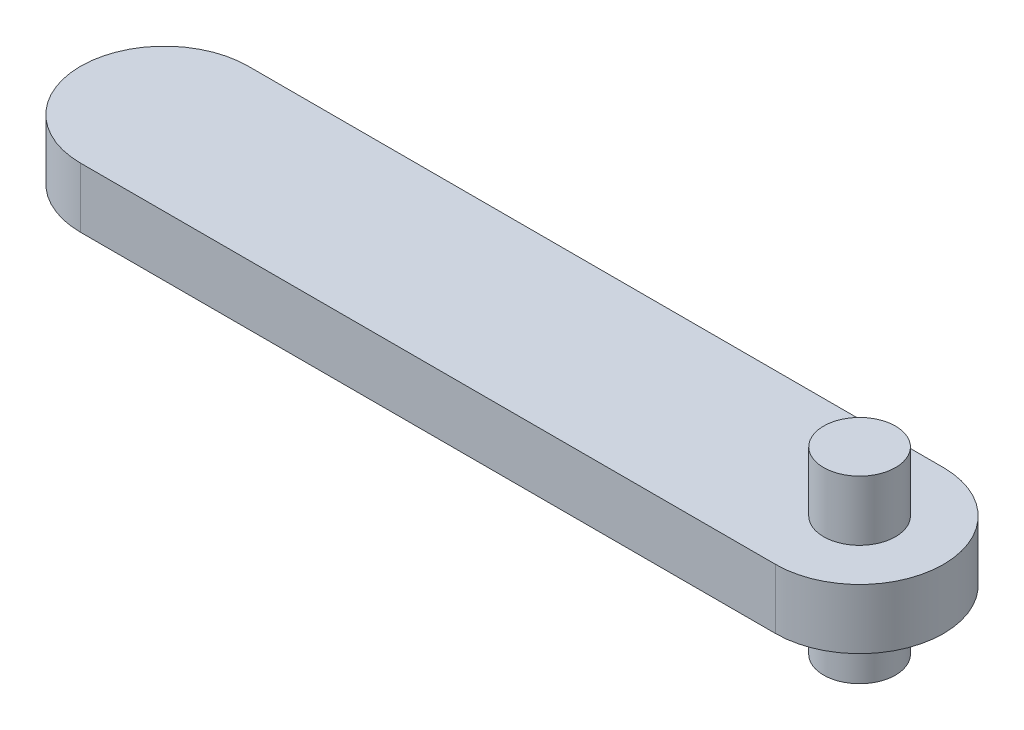
ISO-10303-21;
HEADER;
FILE_DESCRIPTION(('STEP AP214'),'2;1');
FILE_NAME('part.step','',(''),(''),'','','');
FILE_SCHEMA(('AUTOMOTIVE_DESIGN { 1 0 10303 214 1 1 1 1 }'));
ENDSEC;
DATA;
#1=APPLICATION_CONTEXT('core data for automotive mechanical design processes');
#2=APPLICATION_PROTOCOL_DEFINITION('international standard','automotive_design',2000,#1);
#3=PRODUCT_CONTEXT('',#1,'mechanical');
#4=PRODUCT('Part','Part','',(#3));
#5=PRODUCT_RELATED_PRODUCT_CATEGORY('part','',(#4));
#6=PRODUCT_DEFINITION_FORMATION('','',#4);
#7=PRODUCT_DEFINITION_CONTEXT('part definition',#1,'design');
#8=PRODUCT_DEFINITION('design','',#6,#7);
#9=PRODUCT_DEFINITION_SHAPE('','',#8);
#10=(LENGTH_UNIT() NAMED_UNIT(*) SI_UNIT(.MILLI.,.METRE.));
#11=(NAMED_UNIT(*) PLANE_ANGLE_UNIT() SI_UNIT($,.RADIAN.));
#12=(NAMED_UNIT(*) SI_UNIT($,.STERADIAN.) SOLID_ANGLE_UNIT());
#13=UNCERTAINTY_MEASURE_WITH_UNIT(LENGTH_MEASURE(1.E-05),#10,'distance_accuracy_value','');
#14=(GEOMETRIC_REPRESENTATION_CONTEXT(3) GLOBAL_UNCERTAINTY_ASSIGNED_CONTEXT((#13)) GLOBAL_UNIT_ASSIGNED_CONTEXT((#10,
#11,#12)) REPRESENTATION_CONTEXT('',''));
#15=CARTESIAN_POINT('',(0.,0.,0.));
#16=DIRECTION('',(0.,0.,1.));
#17=DIRECTION('',(1.,0.,0.));
#18=AXIS2_PLACEMENT_3D('',#15,#16,#17);
#19=CARTESIAN_POINT('',(-489.944100226293,150.,107.40077744332));
#20=DIRECTION('',(0.,-1.,0.));
#21=DIRECTION('',(0.,0.,-1.));
#22=AXIS2_PLACEMENT_3D('',#19,#20,#21);
#23=PLANE('',#22);
#24=CARTESIAN_POINT('',(-429.944100226293,150.,107.40077744332));
#25=DIRECTION('',(0.,1.,0.));
#26=DIRECTION('',(1.,0.,0.));
#27=AXIS2_PLACEMENT_3D('',#24,#25,#26);
#28=CIRCLE('',#27,15.);
#29=CARTESIAN_POINT('',(-414.944100226293,150.,107.40077744332));
#30=VERTEX_POINT('',#29);
#31=EDGE_CURVE('E100',#30,#30,#28,.T.);
#32=ORIENTED_EDGE('',*,*,#31,.F.);
#33=EDGE_LOOP('',(#32));
#34=FACE_BOUND('',#33,.T.);
#35=DIRECTION('',(1.,0.,0.));
#36=VECTOR('',#35,1.);
#37=CARTESIAN_POINT('',(-519.944100226293,150.,72.4007774433196));
#38=LINE('',#37,#36);
#39=CARTESIAN_POINT('',(-719.944100226293,150.,72.4007774433196));
#40=VERTEX_POINT('',#39);
#41=CARTESIAN_POINT('',(-429.944100226293,150.,72.4007774433196));
#42=VERTEX_POINT('',#41);
#43=EDGE_CURVE('E82',#40,#42,#38,.T.);
#44=ORIENTED_EDGE('',*,*,#43,.F.);
#45=CARTESIAN_POINT('',(-719.944100226293,150.,107.40077744332));
#46=DIRECTION('',(0.,-1.,0.));
#47=DIRECTION('',(0.,0.,1.));
#48=AXIS2_PLACEMENT_3D('',#45,#46,#47);
#49=CIRCLE('',#48,35.);
#50=CARTESIAN_POINT('',(-719.944100226293,150.,142.40077744332));
#51=VERTEX_POINT('',#50);
#52=EDGE_CURVE('E107',#51,#40,#49,.T.);
#53=ORIENTED_EDGE('',*,*,#52,.F.);
#54=DIRECTION('',(-1.,0.,0.));
#55=VECTOR('',#54,1.);
#56=CARTESIAN_POINT('',(-459.944100226293,150.,142.40077744332));
#57=LINE('',#56,#55);
#58=CARTESIAN_POINT('',(-429.944100226293,150.,142.40077744332));
#59=VERTEX_POINT('',#58);
#60=EDGE_CURVE('E104',#59,#51,#57,.T.);
#61=ORIENTED_EDGE('',*,*,#60,.F.);
#62=CARTESIAN_POINT('',(-429.944100226293,150.,107.40077744332));
#63=DIRECTION('',(0.,-1.,0.));
#64=DIRECTION('',(0.,0.,-1.));
#65=AXIS2_PLACEMENT_3D('',#62,#63,#64);
#66=CIRCLE('',#65,35.);
#67=EDGE_CURVE('E68',#42,#59,#66,.T.);
#68=ORIENTED_EDGE('',*,*,#67,.F.);
#69=EDGE_LOOP('',(#44,#53,#61,#68));
#70=FACE_BOUND('',#69,.T.);
#71=ADVANCED_FACE('F43',(#34,#70),#23,.F.);
#72=CARTESIAN_POINT('',(-429.944100226293,175.,107.40077744332));
#73=DIRECTION('',(0.,-1.,0.));
#74=DIRECTION('',(0.,0.,-1.));
#75=AXIS2_PLACEMENT_3D('',#72,#73,#74);
#76=PLANE('',#75);
#77=CARTESIAN_POINT('',(-429.944100226293,175.,107.40077744332));
#78=DIRECTION('',(0.,1.,0.));
#79=DIRECTION('',(1.,0.,0.));
#80=AXIS2_PLACEMENT_3D('',#77,#78,#79);
#81=CIRCLE('',#80,15.);
#82=CARTESIAN_POINT('',(-414.944100226293,175.,107.40077744332));
#83=VERTEX_POINT('',#82);
#84=EDGE_CURVE('E118',#83,#83,#81,.T.);
#85=ORIENTED_EDGE('',*,*,#84,.T.);
#86=EDGE_LOOP('',(#85));
#87=FACE_BOUND('',#86,.T.);
#88=ADVANCED_FACE('F139',(#87),#76,.F.);
#89=CARTESIAN_POINT('',(-429.944100226293,100.,107.40077744332));
#90=DIRECTION('',(0.,-1.,0.));
#91=DIRECTION('',(1.,0.,0.));
#92=AXIS2_PLACEMENT_3D('',#89,#90,#91);
#93=CYLINDRICAL_SURFACE('',#92,15.);
#94=ORIENTED_EDGE('',*,*,#31,.T.);
#95=EDGE_LOOP('',(#94));
#96=FACE_BOUND('',#95,.T.);
#97=ORIENTED_EDGE('',*,*,#84,.F.);
#98=EDGE_LOOP('',(#97));
#99=FACE_BOUND('',#98,.T.);
#100=ADVANCED_FACE('F144',(#96,#99),#93,.T.);
#101=CARTESIAN_POINT('',(-429.944100226293,125.,107.40077744332));
#102=DIRECTION('',(0.,-1.,0.));
#103=DIRECTION('',(0.,0.,-1.));
#104=AXIS2_PLACEMENT_3D('',#101,#102,#103);
#105=CYLINDRICAL_SURFACE('',#104,35.);
#106=CARTESIAN_POINT('',(-429.944100226293,125.,107.40077744332));
#107=DIRECTION('',(0.,1.,0.));
#108=DIRECTION('',(0.,0.,-1.));
#109=AXIS2_PLACEMENT_3D('',#106,#107,#108);
#110=CIRCLE('',#109,35.);
#111=CARTESIAN_POINT('',(-429.944100226293,125.,142.40077744332));
#112=VERTEX_POINT('',#111);
#113=CARTESIAN_POINT('',(-429.944100226293,125.,72.4007774433196));
#114=VERTEX_POINT('',#113);
#115=EDGE_CURVE('E99',#112,#114,#110,.T.);
#116=ORIENTED_EDGE('',*,*,#115,.T.);
#117=DIRECTION('',(0.,1.,0.));
#118=VECTOR('',#117,1.);
#119=CARTESIAN_POINT('',(-429.944100226293,125.,72.4007774433196));
#120=LINE('',#119,#118);
#121=EDGE_CURVE('E116',#114,#42,#120,.T.);
#122=ORIENTED_EDGE('',*,*,#121,.T.);
#123=ORIENTED_EDGE('',*,*,#67,.T.);
#124=DIRECTION('',(0.,1.,0.));
#125=VECTOR('',#124,1.);
#126=CARTESIAN_POINT('',(-429.944100226293,125.,142.40077744332));
#127=LINE('',#126,#125);
#128=EDGE_CURVE('E101',#112,#59,#127,.T.);
#129=ORIENTED_EDGE('',*,*,#128,.F.);
#130=EDGE_LOOP('',(#116,#122,#123,#129));
#131=FACE_BOUND('',#130,.T.);
#132=ADVANCED_FACE('F128',(#131),#105,.T.);
#133=CARTESIAN_POINT('',(-429.944100226293,100.,107.40077744332));
#134=DIRECTION('',(0.,1.,0.));
#135=DIRECTION('',(1.,0.,0.));
#136=AXIS2_PLACEMENT_3D('',#133,#134,#135);
#137=PLANE('',#136);
#138=CARTESIAN_POINT('',(-429.944100226293,100.,107.40077744332));
#139=DIRECTION('',(0.,-1.,0.));
#140=DIRECTION('',(1.,0.,0.));
#141=AXIS2_PLACEMENT_3D('',#138,#139,#140);
#142=CIRCLE('',#141,15.);
#143=CARTESIAN_POINT('',(-414.944100226293,100.,107.40077744332));
#144=VERTEX_POINT('',#143);
#145=EDGE_CURVE('E52',#144,#144,#142,.T.);
#146=ORIENTED_EDGE('',*,*,#145,.T.);
#147=EDGE_LOOP('',(#146));
#148=FACE_BOUND('',#147,.T.);
#149=ADVANCED_FACE('F151',(#148),#137,.F.);
#150=CARTESIAN_POINT('',(-489.944100226293,125.,107.40077744332));
#151=DIRECTION('',(0.,-1.,0.));
#152=DIRECTION('',(0.,0.,-1.));
#153=AXIS2_PLACEMENT_3D('',#150,#151,#152);
#154=PLANE('',#153);
#155=CARTESIAN_POINT('',(-429.944100226293,125.,107.40077744332));
#156=DIRECTION('',(0.,-1.,0.));
#157=DIRECTION('',(1.,0.,0.));
#158=AXIS2_PLACEMENT_3D('',#155,#156,#157);
#159=CIRCLE('',#158,15.);
#160=CARTESIAN_POINT('',(-414.944100226293,125.,107.40077744332));
#161=VERTEX_POINT('',#160);
#162=EDGE_CURVE('E12',#161,#161,#159,.T.);
#163=ORIENTED_EDGE('',*,*,#162,.F.);
#164=EDGE_LOOP('',(#163));
#165=FACE_BOUND('',#164,.T.);
#166=DIRECTION('',(1.,0.,0.));
#167=VECTOR('',#166,1.);
#168=CARTESIAN_POINT('',(-459.944100226293,125.,142.40077744332));
#169=LINE('',#168,#167);
#170=CARTESIAN_POINT('',(-719.944100226293,125.,142.40077744332));
#171=VERTEX_POINT('',#170);
#172=EDGE_CURVE('E47',#171,#112,#169,.T.);
#173=ORIENTED_EDGE('',*,*,#172,.F.);
#174=CARTESIAN_POINT('',(-719.944100226293,125.,107.40077744332));
#175=DIRECTION('',(0.,1.,0.));
#176=DIRECTION('',(0.,0.,1.));
#177=AXIS2_PLACEMENT_3D('',#174,#175,#176);
#178=CIRCLE('',#177,35.);
#179=CARTESIAN_POINT('',(-719.944100226293,125.,72.4007774433196));
#180=VERTEX_POINT('',#179);
#181=EDGE_CURVE('E97',#180,#171,#178,.T.);
#182=ORIENTED_EDGE('',*,*,#181,.F.);
#183=DIRECTION('',(-1.,0.,0.));
#184=VECTOR('',#183,1.);
#185=CARTESIAN_POINT('',(-519.944100226293,125.,72.4007774433196));
#186=LINE('',#185,#184);
#187=EDGE_CURVE('E91',#114,#180,#186,.T.);
#188=ORIENTED_EDGE('',*,*,#187,.F.);
#189=ORIENTED_EDGE('',*,*,#115,.F.);
#190=EDGE_LOOP('',(#173,#182,#188,#189));
#191=FACE_BOUND('',#190,.T.);
#192=ADVANCED_FACE('F95',(#165,#191),#154,.T.);
#193=CARTESIAN_POINT('',(-429.944100226293,100.,107.40077744332));
#194=DIRECTION('',(0.,-1.,0.));
#195=DIRECTION('',(1.,0.,0.));
#196=AXIS2_PLACEMENT_3D('',#193,#194,#195);
#197=CYLINDRICAL_SURFACE('',#196,15.);
#198=ORIENTED_EDGE('',*,*,#145,.F.);
#199=EDGE_LOOP('',(#198));
#200=FACE_BOUND('',#199,.T.);
#201=ORIENTED_EDGE('',*,*,#162,.T.);
#202=EDGE_LOOP('',(#201));
#203=FACE_BOUND('',#202,.T.);
#204=ADVANCED_FACE('F136',(#200,#203),#197,.T.);
#205=CARTESIAN_POINT('',(-429.944100226293,125.,142.40077744332));
#206=DIRECTION('',(0.,0.,-1.));
#207=DIRECTION('',(-1.,0.,0.));
#208=AXIS2_PLACEMENT_3D('',#205,#206,#207);
#209=PLANE('',#208);
#210=ORIENTED_EDGE('',*,*,#60,.T.);
#211=DIRECTION('',(0.,1.,0.));
#212=VECTOR('',#211,1.);
#213=CARTESIAN_POINT('',(-719.944100226293,125.,142.40077744332));
#214=LINE('',#213,#212);
#215=EDGE_CURVE('E103',#171,#51,#214,.T.);
#216=ORIENTED_EDGE('',*,*,#215,.F.);
#217=ORIENTED_EDGE('',*,*,#172,.T.);
#218=ORIENTED_EDGE('',*,*,#128,.T.);
#219=EDGE_LOOP('',(#210,#216,#217,#218));
#220=FACE_BOUND('',#219,.T.);
#221=ADVANCED_FACE('F45',(#220),#209,.F.);
#222=CARTESIAN_POINT('',(-549.944100226293,125.,72.4007774433196));
#223=DIRECTION('',(0.,0.,1.));
#224=DIRECTION('',(1.,0.,0.));
#225=AXIS2_PLACEMENT_3D('',#222,#223,#224);
#226=PLANE('',#225);
#227=ORIENTED_EDGE('',*,*,#187,.T.);
#228=DIRECTION('',(0.,1.,0.));
#229=VECTOR('',#228,1.);
#230=CARTESIAN_POINT('',(-719.944100226293,125.,72.4007774433196));
#231=LINE('',#230,#229);
#232=EDGE_CURVE('E110',#180,#40,#231,.T.);
#233=ORIENTED_EDGE('',*,*,#232,.T.);
#234=ORIENTED_EDGE('',*,*,#43,.T.);
#235=ORIENTED_EDGE('',*,*,#121,.F.);
#236=EDGE_LOOP('',(#227,#233,#234,#235));
#237=FACE_BOUND('',#236,.T.);
#238=ADVANCED_FACE('F129',(#237),#226,.F.);
#239=CARTESIAN_POINT('',(-719.944100226293,125.,107.40077744332));
#240=DIRECTION('',(0.,-1.,0.));
#241=DIRECTION('',(0.,0.,1.));
#242=AXIS2_PLACEMENT_3D('',#239,#240,#241);
#243=CYLINDRICAL_SURFACE('',#242,35.);
#244=ORIENTED_EDGE('',*,*,#181,.T.);
#245=ORIENTED_EDGE('',*,*,#215,.T.);
#246=ORIENTED_EDGE('',*,*,#52,.T.);
#247=ORIENTED_EDGE('',*,*,#232,.F.);
#248=EDGE_LOOP('',(#244,#245,#246,#247));
#249=FACE_BOUND('',#248,.T.);
#250=ADVANCED_FACE('F109',(#249),#243,.T.);
#251=CLOSED_SHELL('',(#71,#88,#100,#132,#149,#192,#204,#221,#238,#250));
#252=MANIFOLD_SOLID_BREP('B2',#251);
#253=ADVANCED_BREP_SHAPE_REPRESENTATION('',(#18,#252),#14);
#254=SHAPE_DEFINITION_REPRESENTATION(#9,#253);
ENDSEC;
END-ISO-10303-21;
